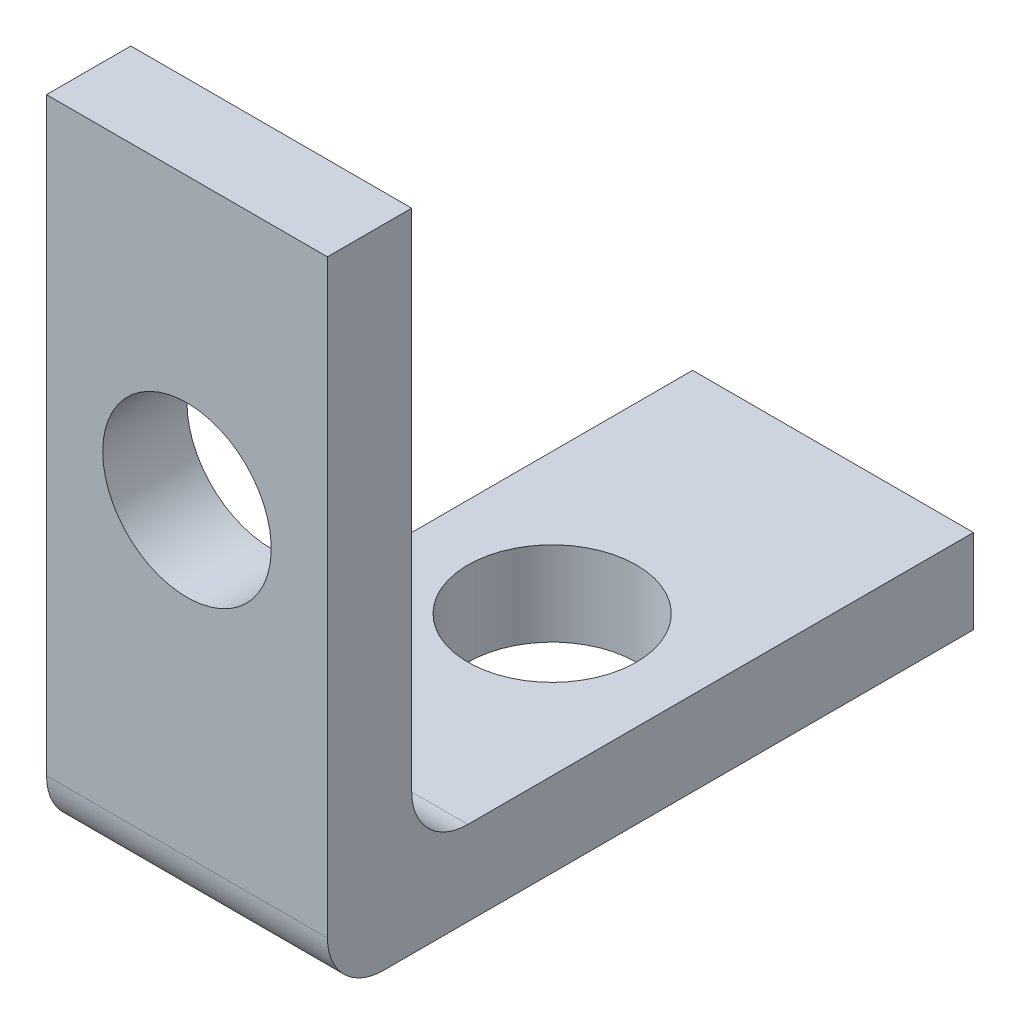
ISO-10303-21;
HEADER;
FILE_DESCRIPTION(('STEP AP214'),'2;1');
FILE_NAME('part.step','',(''),(''),'','','');
FILE_SCHEMA(('AUTOMOTIVE_DESIGN { 1 0 10303 214 1 1 1 1 }'));
ENDSEC;
DATA;
#1=APPLICATION_CONTEXT('core data for automotive mechanical design processes');
#2=APPLICATION_PROTOCOL_DEFINITION('international standard','automotive_design',2000,#1);
#3=PRODUCT_CONTEXT('',#1,'mechanical');
#4=PRODUCT('Part','Part','',(#3));
#5=PRODUCT_RELATED_PRODUCT_CATEGORY('part','',(#4));
#6=PRODUCT_DEFINITION_FORMATION('','',#4);
#7=PRODUCT_DEFINITION_CONTEXT('part definition',#1,'design');
#8=PRODUCT_DEFINITION('design','',#6,#7);
#9=PRODUCT_DEFINITION_SHAPE('','',#8);
#10=(LENGTH_UNIT() NAMED_UNIT(*) SI_UNIT(.MILLI.,.METRE.));
#11=(NAMED_UNIT(*) PLANE_ANGLE_UNIT() SI_UNIT($,.RADIAN.));
#12=(NAMED_UNIT(*) SI_UNIT($,.STERADIAN.) SOLID_ANGLE_UNIT());
#13=UNCERTAINTY_MEASURE_WITH_UNIT(LENGTH_MEASURE(1.E-05),#10,'distance_accuracy_value','');
#14=(GEOMETRIC_REPRESENTATION_CONTEXT(3) GLOBAL_UNCERTAINTY_ASSIGNED_CONTEXT((#13)) GLOBAL_UNIT_ASSIGNED_CONTEXT((#10,
#11,#12)) REPRESENTATION_CONTEXT('',''));
#15=CARTESIAN_POINT('',(0.,0.,0.));
#16=DIRECTION('',(0.,0.,1.));
#17=DIRECTION('',(1.,0.,0.));
#18=AXIS2_PLACEMENT_3D('',#15,#16,#17);
#19=CARTESIAN_POINT('',(0.,0.,0.));
#20=DIRECTION('',(0.,0.,-1.));
#21=DIRECTION('',(-1.,0.,0.));
#22=AXIS2_PLACEMENT_3D('',#19,#20,#21);
#23=PLANE('',#22);
#24=DIRECTION('',(0.,1.,0.));
#25=VECTOR('',#24,1.);
#26=CARTESIAN_POINT('',(5.,0.,0.));
#27=LINE('',#26,#25);
#28=CARTESIAN_POINT('',(5.,2.5,0.));
#29=VERTEX_POINT('',#28);
#30=CARTESIAN_POINT('',(5.,11.5,0.));
#31=VERTEX_POINT('',#30);
#32=EDGE_CURVE('E112',#29,#31,#27,.T.);
#33=ORIENTED_EDGE('',*,*,#32,.F.);
#34=DIRECTION('',(1.,0.,0.));
#35=VECTOR('',#34,1.);
#36=CARTESIAN_POINT('',(0.,2.5,0.));
#37=LINE('',#36,#35);
#38=CARTESIAN_POINT('',(0.,2.5,0.));
#39=VERTEX_POINT('',#38);
#40=EDGE_CURVE('E160',#29,#39,#37,.F.);
#41=ORIENTED_EDGE('',*,*,#40,.T.);
#42=DIRECTION('',(0.,-1.,0.));
#43=VECTOR('',#42,1.);
#44=CARTESIAN_POINT('',(0.,0.,0.));
#45=LINE('',#44,#43);
#46=CARTESIAN_POINT('',(0.,11.5,0.));
#47=VERTEX_POINT('',#46);
#48=EDGE_CURVE('E130',#47,#39,#45,.T.);
#49=ORIENTED_EDGE('',*,*,#48,.F.);
#50=DIRECTION('',(-1.,0.,0.));
#51=VECTOR('',#50,1.);
#52=CARTESIAN_POINT('',(0.,11.5,0.));
#53=LINE('',#52,#51);
#54=EDGE_CURVE('E162',#31,#47,#53,.T.);
#55=ORIENTED_EDGE('',*,*,#54,.F.);
#56=EDGE_LOOP('',(#33,#41,#49,#55));
#57=FACE_BOUND('',#56,.T.);
#58=CARTESIAN_POINT('',(2.5,6.5,0.));
#59=DIRECTION('',(0.,0.,-1.));
#60=DIRECTION('',(-1.,0.,0.));
#61=AXIS2_PLACEMENT_3D('',#58,#59,#60);
#62=CIRCLE('',#61,1.5);
#63=CARTESIAN_POINT('',(1.,6.5,0.));
#64=VERTEX_POINT('',#63);
#65=EDGE_CURVE('E192',#64,#64,#62,.F.);
#66=ORIENTED_EDGE('',*,*,#65,.T.);
#67=EDGE_LOOP('',(#66));
#68=FACE_BOUND('',#67,.T.);
#69=ADVANCED_FACE('F33',(#57,#68),#23,.T.);
#70=CARTESIAN_POINT('',(0.,0.,1.5));
#71=DIRECTION('',(0.,0.,-1.));
#72=DIRECTION('',(-1.,0.,0.));
#73=AXIS2_PLACEMENT_3D('',#70,#71,#72);
#74=PLANE('',#73);
#75=DIRECTION('',(0.,-1.,0.));
#76=VECTOR('',#75,1.);
#77=CARTESIAN_POINT('',(0.,0.,1.5));
#78=LINE('',#77,#76);
#79=CARTESIAN_POINT('',(0.,11.5,1.5));
#80=VERTEX_POINT('',#79);
#81=CARTESIAN_POINT('',(0.,1.,1.5));
#82=VERTEX_POINT('',#81);
#83=EDGE_CURVE('E106',#80,#82,#78,.T.);
#84=ORIENTED_EDGE('',*,*,#83,.T.);
#85=DIRECTION('',(1.,0.,0.));
#86=VECTOR('',#85,1.);
#87=CARTESIAN_POINT('',(5.,1.,1.5));
#88=LINE('',#87,#86);
#89=CARTESIAN_POINT('',(5.,1.,1.5));
#90=VERTEX_POINT('',#89);
#91=EDGE_CURVE('E105',#82,#90,#88,.T.);
#92=ORIENTED_EDGE('',*,*,#91,.T.);
#93=DIRECTION('',(0.,1.,0.));
#94=VECTOR('',#93,1.);
#95=CARTESIAN_POINT('',(5.,0.,1.5));
#96=LINE('',#95,#94);
#97=CARTESIAN_POINT('',(5.,11.5,1.5));
#98=VERTEX_POINT('',#97);
#99=EDGE_CURVE('E96',#90,#98,#96,.T.);
#100=ORIENTED_EDGE('',*,*,#99,.T.);
#101=DIRECTION('',(-1.,0.,0.));
#102=VECTOR('',#101,1.);
#103=CARTESIAN_POINT('',(0.,11.5,1.5));
#104=LINE('',#103,#102);
#105=EDGE_CURVE('E102',#98,#80,#104,.T.);
#106=ORIENTED_EDGE('',*,*,#105,.T.);
#107=EDGE_LOOP('',(#84,#92,#100,#106));
#108=FACE_BOUND('',#107,.T.);
#109=CARTESIAN_POINT('',(2.5,6.5,1.5));
#110=DIRECTION('',(0.,0.,-1.));
#111=DIRECTION('',(-1.,0.,0.));
#112=AXIS2_PLACEMENT_3D('',#109,#110,#111);
#113=CIRCLE('',#112,1.5);
#114=CARTESIAN_POINT('',(1.,6.5,1.5));
#115=VERTEX_POINT('',#114);
#116=EDGE_CURVE('E156',#115,#115,#113,.F.);
#117=ORIENTED_EDGE('',*,*,#116,.F.);
#118=EDGE_LOOP('',(#117));
#119=FACE_BOUND('',#118,.T.);
#120=ADVANCED_FACE('F99',(#108,#119),#74,.F.);
#121=CARTESIAN_POINT('',(0.,1.5,0.));
#122=DIRECTION('',(0.,-1.,0.));
#123=DIRECTION('',(0.,0.,-1.));
#124=AXIS2_PLACEMENT_3D('',#121,#122,#123);
#125=PLANE('',#124);
#126=DIRECTION('',(0.,0.,1.));
#127=VECTOR('',#126,1.);
#128=CARTESIAN_POINT('',(0.,1.5,0.));
#129=LINE('',#128,#127);
#130=CARTESIAN_POINT('',(0.,1.5,-10.));
#131=VERTEX_POINT('',#130);
#132=CARTESIAN_POINT('',(0.,1.5,-1.));
#133=VERTEX_POINT('',#132);
#134=EDGE_CURVE('E143',#131,#133,#129,.T.);
#135=ORIENTED_EDGE('',*,*,#134,.T.);
#136=DIRECTION('',(1.,0.,0.));
#137=VECTOR('',#136,1.);
#138=CARTESIAN_POINT('',(0.,1.5,-1.));
#139=LINE('',#138,#137);
#140=CARTESIAN_POINT('',(5.,1.5,-1.));
#141=VERTEX_POINT('',#140);
#142=EDGE_CURVE('E149',#133,#141,#139,.T.);
#143=ORIENTED_EDGE('',*,*,#142,.T.);
#144=DIRECTION('',(0.,0.,-1.));
#145=VECTOR('',#144,1.);
#146=CARTESIAN_POINT('',(5.,1.5,0.));
#147=LINE('',#146,#145);
#148=CARTESIAN_POINT('',(5.,1.5,-10.));
#149=VERTEX_POINT('',#148);
#150=EDGE_CURVE('E137',#141,#149,#147,.T.);
#151=ORIENTED_EDGE('',*,*,#150,.T.);
#152=DIRECTION('',(-1.,0.,0.));
#153=VECTOR('',#152,1.);
#154=CARTESIAN_POINT('',(0.,1.5,-10.));
#155=LINE('',#154,#153);
#156=EDGE_CURVE('E134',#149,#131,#155,.T.);
#157=ORIENTED_EDGE('',*,*,#156,.T.);
#158=EDGE_LOOP('',(#135,#143,#151,#157));
#159=FACE_BOUND('',#158,.T.);
#160=CARTESIAN_POINT('',(2.5,1.5,-5.));
#161=DIRECTION('',(0.,-1.,0.));
#162=DIRECTION('',(0.,0.,-1.));
#163=AXIS2_PLACEMENT_3D('',#160,#161,#162);
#164=CIRCLE('',#163,1.5);
#165=CARTESIAN_POINT('',(2.5,1.5,-6.5));
#166=VERTEX_POINT('',#165);
#167=EDGE_CURVE('E133',#166,#166,#164,.F.);
#168=ORIENTED_EDGE('',*,*,#167,.F.);
#169=EDGE_LOOP('',(#168));
#170=FACE_BOUND('',#169,.T.);
#171=ADVANCED_FACE('F179',(#159,#170),#125,.F.);
#172=CARTESIAN_POINT('',(0.,0.,0.));
#173=DIRECTION('',(0.,-1.,0.));
#174=DIRECTION('',(0.,0.,-1.));
#175=AXIS2_PLACEMENT_3D('',#172,#173,#174);
#176=PLANE('',#175);
#177=DIRECTION('',(0.,0.,-1.));
#178=VECTOR('',#177,1.);
#179=CARTESIAN_POINT('',(5.,0.,0.));
#180=LINE('',#179,#178);
#181=CARTESIAN_POINT('',(5.,0.,0.5));
#182=VERTEX_POINT('',#181);
#183=CARTESIAN_POINT('',(5.,0.,-10.));
#184=VERTEX_POINT('',#183);
#185=EDGE_CURVE('E139',#182,#184,#180,.T.);
#186=ORIENTED_EDGE('',*,*,#185,.F.);
#187=DIRECTION('',(1.,0.,0.));
#188=VECTOR('',#187,1.);
#189=CARTESIAN_POINT('',(0.,0.,0.5));
#190=LINE('',#189,#188);
#191=CARTESIAN_POINT('',(0.,0.,0.5));
#192=VERTEX_POINT('',#191);
#193=EDGE_CURVE('E41',#182,#192,#190,.F.);
#194=ORIENTED_EDGE('',*,*,#193,.T.);
#195=DIRECTION('',(0.,0.,1.));
#196=VECTOR('',#195,1.);
#197=CARTESIAN_POINT('',(0.,0.,0.));
#198=LINE('',#197,#196);
#199=CARTESIAN_POINT('',(0.,0.,-10.));
#200=VERTEX_POINT('',#199);
#201=EDGE_CURVE('E115',#200,#192,#198,.T.);
#202=ORIENTED_EDGE('',*,*,#201,.F.);
#203=DIRECTION('',(-1.,0.,0.));
#204=VECTOR('',#203,1.);
#205=CARTESIAN_POINT('',(0.,0.,-10.));
#206=LINE('',#205,#204);
#207=EDGE_CURVE('E141',#184,#200,#206,.T.);
#208=ORIENTED_EDGE('',*,*,#207,.F.);
#209=EDGE_LOOP('',(#186,#194,#202,#208));
#210=FACE_BOUND('',#209,.T.);
#211=CARTESIAN_POINT('',(2.5,0.,-5.));
#212=DIRECTION('',(0.,-1.,0.));
#213=DIRECTION('',(0.,0.,-1.));
#214=AXIS2_PLACEMENT_3D('',#211,#212,#213);
#215=CIRCLE('',#214,1.5);
#216=CARTESIAN_POINT('',(2.5,0.,-6.5));
#217=VERTEX_POINT('',#216);
#218=EDGE_CURVE('E191',#217,#217,#215,.F.);
#219=ORIENTED_EDGE('',*,*,#218,.T.);
#220=EDGE_LOOP('',(#219));
#221=FACE_BOUND('',#220,.T.);
#222=ADVANCED_FACE('F206',(#210,#221),#176,.T.);
#223=CARTESIAN_POINT('',(0.,1.5,0.));
#224=DIRECTION('',(1.,0.,0.));
#225=DIRECTION('',(0.,0.,-1.));
#226=AXIS2_PLACEMENT_3D('',#223,#224,#225);
#227=PLANE('',#226);
#228=ORIENTED_EDGE('',*,*,#201,.T.);
#229=CARTESIAN_POINT('',(0.,1.,0.5));
#230=DIRECTION('',(1.,0.,0.));
#231=DIRECTION('',(0.,0.,-1.));
#232=AXIS2_PLACEMENT_3D('',#229,#230,#231);
#233=CIRCLE('',#232,1.);
#234=EDGE_CURVE('E11',#192,#82,#233,.F.);
#235=ORIENTED_EDGE('',*,*,#234,.T.);
#236=ORIENTED_EDGE('',*,*,#83,.F.);
#237=DIRECTION('',(0.,0.,-1.));
#238=VECTOR('',#237,1.);
#239=CARTESIAN_POINT('',(0.,11.5,1.5));
#240=LINE('',#239,#238);
#241=EDGE_CURVE('E116',#80,#47,#240,.T.);
#242=ORIENTED_EDGE('',*,*,#241,.T.);
#243=ORIENTED_EDGE('',*,*,#48,.T.);
#244=CARTESIAN_POINT('',(0.,2.5,-1.));
#245=DIRECTION('',(1.,0.,0.));
#246=DIRECTION('',(0.,0.,-1.));
#247=AXIS2_PLACEMENT_3D('',#244,#245,#246);
#248=CIRCLE('',#247,1.);
#249=EDGE_CURVE('E166',#39,#133,#248,.T.);
#250=ORIENTED_EDGE('',*,*,#249,.T.);
#251=ORIENTED_EDGE('',*,*,#134,.F.);
#252=DIRECTION('',(0.,-1.,0.));
#253=VECTOR('',#252,1.);
#254=CARTESIAN_POINT('',(0.,1.5,-10.));
#255=LINE('',#254,#253);
#256=EDGE_CURVE('E136',#131,#200,#255,.T.);
#257=ORIENTED_EDGE('',*,*,#256,.T.);
#258=EDGE_LOOP('',(#228,#235,#236,#242,#243,#250,#251,#257));
#259=FACE_BOUND('',#258,.T.);
#260=ADVANCED_FACE('F173',(#259),#227,.F.);
#261=CARTESIAN_POINT('',(5.,1.5,0.));
#262=DIRECTION('',(-1.,0.,0.));
#263=DIRECTION('',(0.,0.,1.));
#264=AXIS2_PLACEMENT_3D('',#261,#262,#263);
#265=PLANE('',#264);
#266=ORIENTED_EDGE('',*,*,#99,.F.);
#267=CARTESIAN_POINT('',(5.,1.,0.5));
#268=DIRECTION('',(-1.,0.,0.));
#269=DIRECTION('',(0.,0.,1.));
#270=AXIS2_PLACEMENT_3D('',#267,#268,#269);
#271=CIRCLE('',#270,1.);
#272=EDGE_CURVE('E55',#90,#182,#271,.F.);
#273=ORIENTED_EDGE('',*,*,#272,.T.);
#274=ORIENTED_EDGE('',*,*,#185,.T.);
#275=DIRECTION('',(0.,-1.,0.));
#276=VECTOR('',#275,1.);
#277=CARTESIAN_POINT('',(5.,1.5,-10.));
#278=LINE('',#277,#276);
#279=EDGE_CURVE('E146',#149,#184,#278,.T.);
#280=ORIENTED_EDGE('',*,*,#279,.F.);
#281=ORIENTED_EDGE('',*,*,#150,.F.);
#282=CARTESIAN_POINT('',(5.,2.5,-1.));
#283=DIRECTION('',(-1.,0.,0.));
#284=DIRECTION('',(0.,0.,1.));
#285=AXIS2_PLACEMENT_3D('',#282,#283,#284);
#286=CIRCLE('',#285,1.);
#287=EDGE_CURVE('E164',#141,#29,#286,.T.);
#288=ORIENTED_EDGE('',*,*,#287,.T.);
#289=ORIENTED_EDGE('',*,*,#32,.T.);
#290=DIRECTION('',(0.,0.,-1.));
#291=VECTOR('',#290,1.);
#292=CARTESIAN_POINT('',(5.,11.5,1.5));
#293=LINE('',#292,#291);
#294=EDGE_CURVE('E109',#98,#31,#293,.T.);
#295=ORIENTED_EDGE('',*,*,#294,.F.);
#296=EDGE_LOOP('',(#266,#273,#274,#280,#281,#288,#289,#295));
#297=FACE_BOUND('',#296,.T.);
#298=ADVANCED_FACE('F110',(#297),#265,.F.);
#299=CARTESIAN_POINT('',(0.,1.5,-10.));
#300=DIRECTION('',(0.,0.,1.));
#301=DIRECTION('',(1.,0.,0.));
#302=AXIS2_PLACEMENT_3D('',#299,#300,#301);
#303=PLANE('',#302);
#304=ORIENTED_EDGE('',*,*,#207,.T.);
#305=ORIENTED_EDGE('',*,*,#256,.F.);
#306=ORIENTED_EDGE('',*,*,#156,.F.);
#307=ORIENTED_EDGE('',*,*,#279,.T.);
#308=EDGE_LOOP('',(#304,#305,#306,#307));
#309=FACE_BOUND('',#308,.T.);
#310=ADVANCED_FACE('F214',(#309),#303,.F.);
#311=CARTESIAN_POINT('',(0.,11.5,1.5));
#312=DIRECTION('',(0.,-1.,0.));
#313=DIRECTION('',(0.,0.,-1.));
#314=AXIS2_PLACEMENT_3D('',#311,#312,#313);
#315=PLANE('',#314);
#316=ORIENTED_EDGE('',*,*,#54,.T.);
#317=ORIENTED_EDGE('',*,*,#241,.F.);
#318=ORIENTED_EDGE('',*,*,#105,.F.);
#319=ORIENTED_EDGE('',*,*,#294,.T.);
#320=EDGE_LOOP('',(#316,#317,#318,#319));
#321=FACE_BOUND('',#320,.T.);
#322=ADVANCED_FACE('F118',(#321),#315,.F.);
#323=CARTESIAN_POINT('',(2.5,3.,-5.));
#324=DIRECTION('',(0.,-1.,0.));
#325=DIRECTION('',(0.,0.,-1.));
#326=AXIS2_PLACEMENT_3D('',#323,#324,#325);
#327=CYLINDRICAL_SURFACE('',#326,1.5);
#328=ORIENTED_EDGE('',*,*,#218,.F.);
#329=EDGE_LOOP('',(#328));
#330=FACE_BOUND('',#329,.T.);
#331=ORIENTED_EDGE('',*,*,#167,.T.);
#332=EDGE_LOOP('',(#331));
#333=FACE_BOUND('',#332,.T.);
#334=ADVANCED_FACE('F210',(#330,#333),#327,.F.);
#335=CARTESIAN_POINT('',(2.5,6.5,-10.));
#336=DIRECTION('',(0.,0.,1.));
#337=DIRECTION('',(1.,0.,0.));
#338=AXIS2_PLACEMENT_3D('',#335,#336,#337);
#339=CYLINDRICAL_SURFACE('',#338,1.5);
#340=ORIENTED_EDGE('',*,*,#65,.F.);
#341=EDGE_LOOP('',(#340));
#342=FACE_BOUND('',#341,.T.);
#343=ORIENTED_EDGE('',*,*,#116,.T.);
#344=EDGE_LOOP('',(#343));
#345=FACE_BOUND('',#344,.T.);
#346=ADVANCED_FACE('F199',(#342,#345),#339,.F.);
#347=CARTESIAN_POINT('',(0.,2.5,-1.));
#348=DIRECTION('',(1.,0.,0.));
#349=DIRECTION('',(0.,0.,-1.));
#350=AXIS2_PLACEMENT_3D('',#347,#348,#349);
#351=CYLINDRICAL_SURFACE('',#350,1.);
#352=ORIENTED_EDGE('',*,*,#249,.F.);
#353=ORIENTED_EDGE('',*,*,#40,.F.);
#354=ORIENTED_EDGE('',*,*,#287,.F.);
#355=ORIENTED_EDGE('',*,*,#142,.F.);
#356=EDGE_LOOP('',(#352,#353,#354,#355));
#357=FACE_BOUND('',#356,.T.);
#358=ADVANCED_FACE('F184',(#357),#351,.F.);
#359=CARTESIAN_POINT('',(0.,1.,0.5));
#360=DIRECTION('',(-1.,0.,0.));
#361=DIRECTION('',(0.,0.,1.));
#362=AXIS2_PLACEMENT_3D('',#359,#360,#361);
#363=CYLINDRICAL_SURFACE('',#362,1.);
#364=ORIENTED_EDGE('',*,*,#234,.F.);
#365=ORIENTED_EDGE('',*,*,#193,.F.);
#366=ORIENTED_EDGE('',*,*,#272,.F.);
#367=ORIENTED_EDGE('',*,*,#91,.F.);
#368=EDGE_LOOP('',(#364,#365,#366,#367));
#369=FACE_BOUND('',#368,.T.);
#370=ADVANCED_FACE('F35',(#369),#363,.T.);
#371=CLOSED_SHELL('',(#69,#120,#171,#222,#260,#298,#310,#322,#334,#346,#358,#370));
#372=MANIFOLD_SOLID_BREP('B2',#371);
#373=ADVANCED_BREP_SHAPE_REPRESENTATION('',(#18,#372),#14);
#374=SHAPE_DEFINITION_REPRESENTATION(#9,#373);
ENDSEC;
END-ISO-10303-21;
